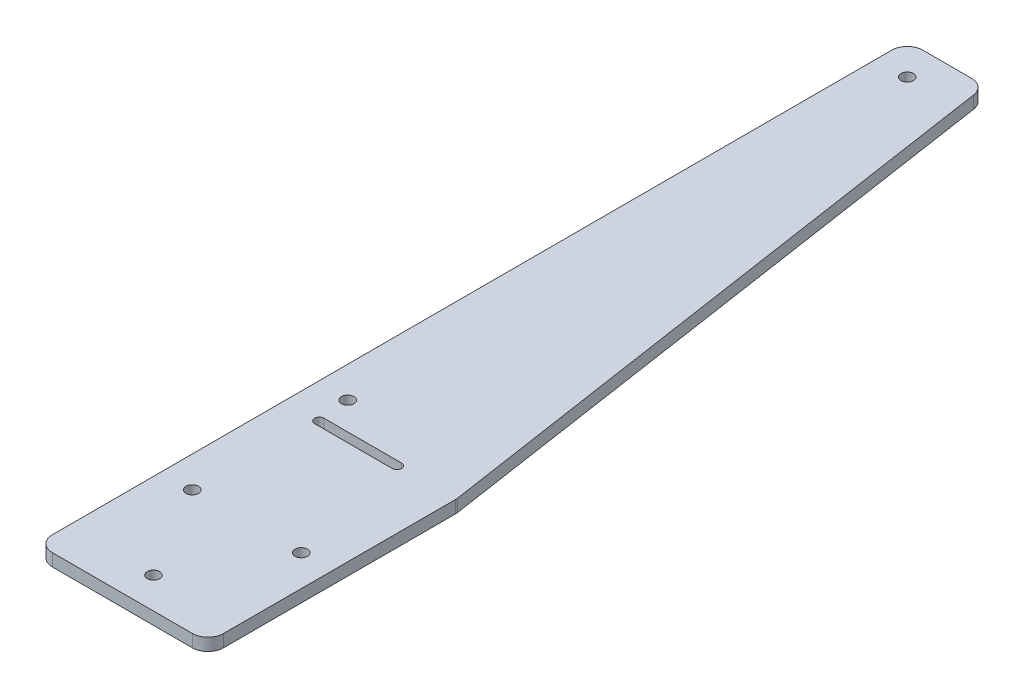
ISO-10303-21;
HEADER;
FILE_DESCRIPTION(('STEP AP214'),'2;1');
FILE_NAME('part.step','',(''),(''),'','','');
FILE_SCHEMA(('AUTOMOTIVE_DESIGN { 1 0 10303 214 1 1 1 1 }'));
ENDSEC;
DATA;
#1=APPLICATION_CONTEXT('core data for automotive mechanical design processes');
#2=APPLICATION_PROTOCOL_DEFINITION('international standard','automotive_design',2000,#1);
#3=PRODUCT_CONTEXT('',#1,'mechanical');
#4=PRODUCT('Part','Part','',(#3));
#5=PRODUCT_RELATED_PRODUCT_CATEGORY('part','',(#4));
#6=PRODUCT_DEFINITION_FORMATION('','',#4);
#7=PRODUCT_DEFINITION_CONTEXT('part definition',#1,'design');
#8=PRODUCT_DEFINITION('design','',#6,#7);
#9=PRODUCT_DEFINITION_SHAPE('','',#8);
#10=(LENGTH_UNIT() NAMED_UNIT(*) SI_UNIT(.MILLI.,.METRE.));
#11=(NAMED_UNIT(*) PLANE_ANGLE_UNIT() SI_UNIT($,.RADIAN.));
#12=(NAMED_UNIT(*) SI_UNIT($,.STERADIAN.) SOLID_ANGLE_UNIT());
#13=UNCERTAINTY_MEASURE_WITH_UNIT(LENGTH_MEASURE(1.E-05),#10,'distance_accuracy_value','');
#14=(GEOMETRIC_REPRESENTATION_CONTEXT(3) GLOBAL_UNCERTAINTY_ASSIGNED_CONTEXT((#13)) GLOBAL_UNIT_ASSIGNED_CONTEXT((#10,
#11,#12)) REPRESENTATION_CONTEXT('',''));
#15=CARTESIAN_POINT('',(0.,0.,0.));
#16=DIRECTION('',(0.,0.,1.));
#17=DIRECTION('',(1.,0.,0.));
#18=AXIS2_PLACEMENT_3D('',#15,#16,#17);
#19=CARTESIAN_POINT('',(-47.5,2.,80.8962264150943));
#20=DIRECTION('',(0.,1.,0.));
#21=DIRECTION('',(0.,0.,1.));
#22=AXIS2_PLACEMENT_3D('',#19,#20,#21);
#23=PLANE('',#22);
#24=CARTESIAN_POINT('',(-45.,2.,-51.6037735849057));
#25=DIRECTION('',(0.,1.,0.));
#26=DIRECTION('',(0.,0.,1.));
#27=AXIS2_PLACEMENT_3D('',#24,#25,#26);
#28=CIRCLE('',#27,0.999999999999998);
#29=CARTESIAN_POINT('',(-45.,2.,-50.6037735849057));
#30=VERTEX_POINT('',#29);
#31=EDGE_CURVE('E172',#30,#30,#28,.T.);
#32=ORIENTED_EDGE('',*,*,#31,.F.);
#33=EDGE_LOOP('',(#32));
#34=FACE_BOUND('',#33,.T.);
#35=CARTESIAN_POINT('',(-27.48,2.,63.3962264150943));
#36=DIRECTION('',(0.,1.,0.));
#37=DIRECTION('',(0.,0.,-1.));
#38=AXIS2_PLACEMENT_3D('',#35,#36,#37);
#39=CIRCLE('',#38,0.999999999999998);
#40=CARTESIAN_POINT('',(-27.48,2.,62.3962264150943));
#41=VERTEX_POINT('',#40);
#42=EDGE_CURVE('E184',#41,#41,#39,.T.);
#43=ORIENTED_EDGE('',*,*,#42,.F.);
#44=EDGE_LOOP('',(#43));
#45=FACE_BOUND('',#44,.T.);
#46=CARTESIAN_POINT('',(-36.24,2.,78.3962264150943));
#47=DIRECTION('',(0.,1.,0.));
#48=DIRECTION('',(0.,0.,1.));
#49=AXIS2_PLACEMENT_3D('',#46,#47,#48);
#50=CIRCLE('',#49,0.999999999999998);
#51=CARTESIAN_POINT('',(-36.24,2.,79.3962264150943));
#52=VERTEX_POINT('',#51);
#53=EDGE_CURVE('E196',#52,#52,#50,.T.);
#54=ORIENTED_EDGE('',*,*,#53,.F.);
#55=EDGE_LOOP('',(#54));
#56=FACE_BOUND('',#55,.T.);
#57=DIRECTION('',(0.,0.,1.));
#58=VECTOR('',#57,1.);
#59=CARTESIAN_POINT('',(-50.,2.,63.3962264150943));
#60=LINE('',#59,#58);
#61=CARTESIAN_POINT('',(-50.,2.,-54.1037735849057));
#62=VERTEX_POINT('',#61);
#63=CARTESIAN_POINT('',(-50.,2.,80.8962264150943));
#64=VERTEX_POINT('',#63);
#65=EDGE_CURVE('E202',#62,#64,#60,.T.);
#66=ORIENTED_EDGE('',*,*,#65,.T.);
#67=CARTESIAN_POINT('',(-47.5,2.,80.8962264150943));
#68=DIRECTION('',(0.,1.,0.));
#69=DIRECTION('',(0.,0.,1.));
#70=AXIS2_PLACEMENT_3D('',#67,#68,#69);
#71=CIRCLE('',#70,2.5);
#72=CARTESIAN_POINT('',(-47.5,2.,83.3962264150943));
#73=VERTEX_POINT('',#72);
#74=EDGE_CURVE('E204',#64,#73,#71,.T.);
#75=ORIENTED_EDGE('',*,*,#74,.T.);
#76=DIRECTION('',(1.,0.,0.));
#77=VECTOR('',#76,1.);
#78=CARTESIAN_POINT('',(-47.5,2.,83.3962264150943));
#79=LINE('',#78,#77);
#80=CARTESIAN_POINT('',(-24.98,2.,83.3962264150943));
#81=VERTEX_POINT('',#80);
#82=EDGE_CURVE('E207',#73,#81,#79,.T.);
#83=ORIENTED_EDGE('',*,*,#82,.T.);
#84=CARTESIAN_POINT('',(-24.98,2.,80.8962264150943));
#85=DIRECTION('',(0.,1.,0.));
#86=DIRECTION('',(0.,0.,1.));
#87=AXIS2_PLACEMENT_3D('',#84,#85,#86);
#88=CIRCLE('',#87,2.5);
#89=CARTESIAN_POINT('',(-22.48,2.,80.8962264150943));
#90=VERTEX_POINT('',#89);
#91=EDGE_CURVE('E209',#81,#90,#88,.T.);
#92=ORIENTED_EDGE('',*,*,#91,.T.);
#93=DIRECTION('',(0.,0.,-1.));
#94=VECTOR('',#93,1.);
#95=CARTESIAN_POINT('',(-22.48,2.,80.8962264150943));
#96=LINE('',#95,#94);
#97=CARTESIAN_POINT('',(-22.48,2.,43.582929281961));
#98=VERTEX_POINT('',#97);
#99=EDGE_CURVE('E211',#90,#98,#96,.T.);
#100=ORIENTED_EDGE('',*,*,#99,.T.);
#101=CARTESIAN_POINT('',(-24.98,2.,43.582929281961));
#102=DIRECTION('',(0.,1.,0.));
#103=DIRECTION('',(0.,0.,-1.));
#104=AXIS2_PLACEMENT_3D('',#101,#102,#103);
#105=CIRCLE('',#104,2.5);
#106=CARTESIAN_POINT('',(-22.5077317011103,2.,43.2115945834678));
#107=VERTEX_POINT('',#106);
#108=EDGE_CURVE('E213',#98,#107,#105,.T.);
#109=ORIENTED_EDGE('',*,*,#108,.T.);
#110=DIRECTION('',(-0.148533879397293,0.,-0.988907319555878));
#111=VECTOR('',#110,1.);
#112=CARTESIAN_POINT('',(-37.1802744717137,2.,-54.4751082833989));
#113=LINE('',#112,#111);
#114=CARTESIAN_POINT('',(-37.1802744717137,2.,-54.4751082833989));
#115=VERTEX_POINT('',#114);
#116=EDGE_CURVE('E215',#107,#115,#113,.T.);
#117=ORIENTED_EDGE('',*,*,#116,.T.);
#118=CARTESIAN_POINT('',(-39.6525427706034,2.,-54.1037735849057));
#119=DIRECTION('',(0.,1.,0.));
#120=DIRECTION('',(0.,0.,-1.));
#121=AXIS2_PLACEMENT_3D('',#118,#119,#120);
#122=CIRCLE('',#121,2.5);
#123=CARTESIAN_POINT('',(-39.6525427706034,2.,-56.6037735849057));
#124=VERTEX_POINT('',#123);
#125=EDGE_CURVE('E217',#115,#124,#122,.T.);
#126=ORIENTED_EDGE('',*,*,#125,.T.);
#127=DIRECTION('',(-1.,0.,0.));
#128=VECTOR('',#127,1.);
#129=CARTESIAN_POINT('',(-47.5,2.,-56.6037735849057));
#130=LINE('',#129,#128);
#131=CARTESIAN_POINT('',(-47.5,2.,-56.6037735849057));
#132=VERTEX_POINT('',#131);
#133=EDGE_CURVE('E219',#124,#132,#130,.T.);
#134=ORIENTED_EDGE('',*,*,#133,.T.);
#135=CARTESIAN_POINT('',(-47.5,2.,-54.1037735849057));
#136=DIRECTION('',(0.,1.,0.));
#137=DIRECTION('',(0.,0.,-1.));
#138=AXIS2_PLACEMENT_3D('',#135,#136,#137);
#139=CIRCLE('',#138,2.5);
#140=EDGE_CURVE('E221',#132,#62,#139,.T.);
#141=ORIENTED_EDGE('',*,*,#140,.T.);
#142=EDGE_LOOP('',(#66,#75,#83,#92,#100,#109,#117,#126,#134,#141));
#143=FACE_BOUND('',#142,.T.);
#144=CARTESIAN_POINT('',(-45.,2.,63.3962264150943));
#145=DIRECTION('',(0.,1.,0.));
#146=DIRECTION('',(0.,0.,1.));
#147=AXIS2_PLACEMENT_3D('',#144,#145,#146);
#148=CIRCLE('',#147,0.999999999999998);
#149=CARTESIAN_POINT('',(-45.,2.,64.3962264150943));
#150=VERTEX_POINT('',#149);
#151=EDGE_CURVE('E190',#150,#150,#148,.T.);
#152=ORIENTED_EDGE('',*,*,#151,.F.);
#153=EDGE_LOOP('',(#152));
#154=FACE_BOUND('',#153,.T.);
#155=CARTESIAN_POINT('',(-45.,2.,38.3962264150943));
#156=DIRECTION('',(0.,1.,0.));
#157=DIRECTION('',(0.,0.,1.));
#158=AXIS2_PLACEMENT_3D('',#155,#156,#157);
#159=CIRCLE('',#158,0.999999999999998);
#160=CARTESIAN_POINT('',(-45.,2.,39.3962264150943));
#161=VERTEX_POINT('',#160);
#162=EDGE_CURVE('E178',#161,#161,#159,.T.);
#163=ORIENTED_EDGE('',*,*,#162,.F.);
#164=EDGE_LOOP('',(#163));
#165=FACE_BOUND('',#164,.T.);
#166=DIRECTION('',(1.,0.,0.));
#167=VECTOR('',#166,1.);
#168=CARTESIAN_POINT('',(-44.38816659016,2.,44.332929281961));
#169=LINE('',#168,#167);
#170=CARTESIAN_POINT('',(-44.38816659016,2.,44.332929281961));
#171=VERTEX_POINT('',#170);
#172=CARTESIAN_POINT('',(-31.88816659016,2.,44.332929281961));
#173=VERTEX_POINT('',#172);
#174=EDGE_CURVE('E144',#171,#173,#169,.T.);
#175=ORIENTED_EDGE('',*,*,#174,.F.);
#176=CARTESIAN_POINT('',(-44.38816659016,2.,43.582929281961));
#177=DIRECTION('',(0.,1.,0.));
#178=DIRECTION('',(0.,0.,1.));
#179=AXIS2_PLACEMENT_3D('',#176,#177,#178);
#180=CIRCLE('',#179,0.750000000000001);
#181=CARTESIAN_POINT('',(-44.38816659016,2.,42.832929281961));
#182=VERTEX_POINT('',#181);
#183=EDGE_CURVE('E136',#182,#171,#180,.T.);
#184=ORIENTED_EDGE('',*,*,#183,.F.);
#185=DIRECTION('',(-1.,0.,0.));
#186=VECTOR('',#185,1.);
#187=CARTESIAN_POINT('',(-44.38816659016,2.,42.832929281961));
#188=LINE('',#187,#186);
#189=CARTESIAN_POINT('',(-31.88816659016,2.,42.832929281961));
#190=VERTEX_POINT('',#189);
#191=EDGE_CURVE('E158',#190,#182,#188,.T.);
#192=ORIENTED_EDGE('',*,*,#191,.F.);
#193=CARTESIAN_POINT('',(-31.88816659016,2.,43.582929281961));
#194=DIRECTION('',(0.,1.,0.));
#195=DIRECTION('',(0.,0.,1.));
#196=AXIS2_PLACEMENT_3D('',#193,#194,#195);
#197=CIRCLE('',#196,0.749999999999997);
#198=EDGE_CURVE('E156',#173,#190,#197,.T.);
#199=ORIENTED_EDGE('',*,*,#198,.F.);
#200=EDGE_LOOP('',(#175,#184,#192,#199));
#201=FACE_BOUND('',#200,.T.);
#202=ADVANCED_FACE('F35',(#34,#45,#56,#143,#154,#165,#201),#23,.T.);
#203=CARTESIAN_POINT('',(-47.5,0.,80.8962264150943));
#204=DIRECTION('',(0.,1.,0.));
#205=DIRECTION('',(0.,0.,1.));
#206=AXIS2_PLACEMENT_3D('',#203,#204,#205);
#207=PLANE('',#206);
#208=CARTESIAN_POINT('',(-45.,0.,-51.6037735849057));
#209=DIRECTION('',(0.,1.,0.));
#210=DIRECTION('',(0.,0.,1.));
#211=AXIS2_PLACEMENT_3D('',#208,#209,#210);
#212=CIRCLE('',#211,0.999999999999998);
#213=CARTESIAN_POINT('',(-45.,0.,-50.6037735849057));
#214=VERTEX_POINT('',#213);
#215=EDGE_CURVE('E152',#214,#214,#212,.T.);
#216=ORIENTED_EDGE('',*,*,#215,.T.);
#217=EDGE_LOOP('',(#216));
#218=FACE_BOUND('',#217,.T.);
#219=CARTESIAN_POINT('',(-27.48,0.,63.3962264150943));
#220=DIRECTION('',(0.,1.,0.));
#221=DIRECTION('',(0.,0.,-1.));
#222=AXIS2_PLACEMENT_3D('',#219,#220,#221);
#223=CIRCLE('',#222,0.999999999999998);
#224=CARTESIAN_POINT('',(-27.48,0.,62.3962264150943));
#225=VERTEX_POINT('',#224);
#226=EDGE_CURVE('E181',#225,#225,#223,.T.);
#227=ORIENTED_EDGE('',*,*,#226,.T.);
#228=EDGE_LOOP('',(#227));
#229=FACE_BOUND('',#228,.T.);
#230=CARTESIAN_POINT('',(-36.24,0.,78.3962264150943));
#231=DIRECTION('',(0.,1.,0.));
#232=DIRECTION('',(0.,0.,1.));
#233=AXIS2_PLACEMENT_3D('',#230,#231,#232);
#234=CIRCLE('',#233,0.999999999999998);
#235=CARTESIAN_POINT('',(-36.24,0.,79.3962264150943));
#236=VERTEX_POINT('',#235);
#237=EDGE_CURVE('E193',#236,#236,#234,.T.);
#238=ORIENTED_EDGE('',*,*,#237,.T.);
#239=EDGE_LOOP('',(#238));
#240=FACE_BOUND('',#239,.T.);
#241=CARTESIAN_POINT('',(-47.5,0.,80.8962264150943));
#242=DIRECTION('',(0.,1.,0.));
#243=DIRECTION('',(0.,0.,1.));
#244=AXIS2_PLACEMENT_3D('',#241,#242,#243);
#245=CIRCLE('',#244,2.5);
#246=CARTESIAN_POINT('',(-50.,0.,80.8962264150943));
#247=VERTEX_POINT('',#246);
#248=CARTESIAN_POINT('',(-47.5,0.,83.3962264150943));
#249=VERTEX_POINT('',#248);
#250=EDGE_CURVE('E199',#247,#249,#245,.T.);
#251=ORIENTED_EDGE('',*,*,#250,.F.);
#252=DIRECTION('',(0.,0.,1.));
#253=VECTOR('',#252,1.);
#254=CARTESIAN_POINT('',(-50.,0.,63.3962264150943));
#255=LINE('',#254,#253);
#256=CARTESIAN_POINT('',(-50.,0.,-54.1037735849057));
#257=VERTEX_POINT('',#256);
#258=EDGE_CURVE('E205',#257,#247,#255,.T.);
#259=ORIENTED_EDGE('',*,*,#258,.F.);
#260=CARTESIAN_POINT('',(-47.5,0.,-54.1037735849057));
#261=DIRECTION('',(0.,1.,0.));
#262=DIRECTION('',(0.,0.,-1.));
#263=AXIS2_PLACEMENT_3D('',#260,#261,#262);
#264=CIRCLE('',#263,2.5);
#265=CARTESIAN_POINT('',(-47.5,0.,-56.6037735849057));
#266=VERTEX_POINT('',#265);
#267=EDGE_CURVE('E241',#266,#257,#264,.T.);
#268=ORIENTED_EDGE('',*,*,#267,.F.);
#269=DIRECTION('',(-1.,0.,0.));
#270=VECTOR('',#269,1.);
#271=CARTESIAN_POINT('',(-47.5,0.,-56.6037735849057));
#272=LINE('',#271,#270);
#273=CARTESIAN_POINT('',(-39.6525427706034,0.,-56.6037735849057));
#274=VERTEX_POINT('',#273);
#275=EDGE_CURVE('E239',#274,#266,#272,.T.);
#276=ORIENTED_EDGE('',*,*,#275,.F.);
#277=CARTESIAN_POINT('',(-39.6525427706034,0.,-54.1037735849057));
#278=DIRECTION('',(0.,1.,0.));
#279=DIRECTION('',(0.,0.,-1.));
#280=AXIS2_PLACEMENT_3D('',#277,#278,#279);
#281=CIRCLE('',#280,2.5);
#282=CARTESIAN_POINT('',(-37.1802744717137,0.,-54.4751082833989));
#283=VERTEX_POINT('',#282);
#284=EDGE_CURVE('E237',#283,#274,#281,.T.);
#285=ORIENTED_EDGE('',*,*,#284,.F.);
#286=DIRECTION('',(-0.148533879397293,0.,-0.988907319555878));
#287=VECTOR('',#286,1.);
#288=CARTESIAN_POINT('',(-37.1802744717137,0.,-54.4751082833989));
#289=LINE('',#288,#287);
#290=CARTESIAN_POINT('',(-22.5077317011103,0.,43.2115945834678));
#291=VERTEX_POINT('',#290);
#292=EDGE_CURVE('E235',#291,#283,#289,.T.);
#293=ORIENTED_EDGE('',*,*,#292,.F.);
#294=CARTESIAN_POINT('',(-24.98,0.,43.582929281961));
#295=DIRECTION('',(0.,1.,0.));
#296=DIRECTION('',(0.,0.,-1.));
#297=AXIS2_PLACEMENT_3D('',#294,#295,#296);
#298=CIRCLE('',#297,2.5);
#299=CARTESIAN_POINT('',(-22.48,0.,43.582929281961));
#300=VERTEX_POINT('',#299);
#301=EDGE_CURVE('E233',#300,#291,#298,.T.);
#302=ORIENTED_EDGE('',*,*,#301,.F.);
#303=DIRECTION('',(0.,0.,-1.));
#304=VECTOR('',#303,1.);
#305=CARTESIAN_POINT('',(-22.48,0.,43.582929281961));
#306=LINE('',#305,#304);
#307=CARTESIAN_POINT('',(-22.48,0.,80.8962264150943));
#308=VERTEX_POINT('',#307);
#309=EDGE_CURVE('E231',#308,#300,#306,.T.);
#310=ORIENTED_EDGE('',*,*,#309,.F.);
#311=CARTESIAN_POINT('',(-24.98,0.,80.8962264150943));
#312=DIRECTION('',(0.,1.,0.));
#313=DIRECTION('',(0.,0.,1.));
#314=AXIS2_PLACEMENT_3D('',#311,#312,#313);
#315=CIRCLE('',#314,2.5);
#316=CARTESIAN_POINT('',(-24.98,0.,83.3962264150943));
#317=VERTEX_POINT('',#316);
#318=EDGE_CURVE('E228',#317,#308,#315,.T.);
#319=ORIENTED_EDGE('',*,*,#318,.F.);
#320=DIRECTION('',(1.,0.,0.));
#321=VECTOR('',#320,1.);
#322=CARTESIAN_POINT('',(-47.5,0.,83.3962264150943));
#323=LINE('',#322,#321);
#324=EDGE_CURVE('E226',#249,#317,#323,.T.);
#325=ORIENTED_EDGE('',*,*,#324,.F.);
#326=EDGE_LOOP('',(#251,#259,#268,#276,#285,#293,#302,#310,#319,#325));
#327=FACE_BOUND('',#326,.T.);
#328=CARTESIAN_POINT('',(-45.,0.,63.3962264150943));
#329=DIRECTION('',(0.,1.,0.));
#330=DIRECTION('',(0.,0.,1.));
#331=AXIS2_PLACEMENT_3D('',#328,#329,#330);
#332=CIRCLE('',#331,0.999999999999998);
#333=CARTESIAN_POINT('',(-45.,0.,64.3962264150943));
#334=VERTEX_POINT('',#333);
#335=EDGE_CURVE('E187',#334,#334,#332,.T.);
#336=ORIENTED_EDGE('',*,*,#335,.T.);
#337=EDGE_LOOP('',(#336));
#338=FACE_BOUND('',#337,.T.);
#339=CARTESIAN_POINT('',(-45.,0.,38.3962264150943));
#340=DIRECTION('',(0.,1.,0.));
#341=DIRECTION('',(0.,0.,1.));
#342=AXIS2_PLACEMENT_3D('',#339,#340,#341);
#343=CIRCLE('',#342,0.999999999999998);
#344=CARTESIAN_POINT('',(-45.,0.,39.3962264150943));
#345=VERTEX_POINT('',#344);
#346=EDGE_CURVE('E175',#345,#345,#343,.T.);
#347=ORIENTED_EDGE('',*,*,#346,.T.);
#348=EDGE_LOOP('',(#347));
#349=FACE_BOUND('',#348,.T.);
#350=CARTESIAN_POINT('',(-44.38816659016,0.,43.582929281961));
#351=DIRECTION('',(0.,1.,0.));
#352=DIRECTION('',(0.,0.,1.));
#353=AXIS2_PLACEMENT_3D('',#350,#351,#352);
#354=CIRCLE('',#353,0.750000000000001);
#355=CARTESIAN_POINT('',(-44.38816659016,0.,42.832929281961));
#356=VERTEX_POINT('',#355);
#357=CARTESIAN_POINT('',(-44.38816659016,0.,44.332929281961));
#358=VERTEX_POINT('',#357);
#359=EDGE_CURVE('E58',#356,#358,#354,.T.);
#360=ORIENTED_EDGE('',*,*,#359,.T.);
#361=DIRECTION('',(1.,0.,0.));
#362=VECTOR('',#361,1.);
#363=CARTESIAN_POINT('',(-44.38816659016,0.,44.332929281961));
#364=LINE('',#363,#362);
#365=CARTESIAN_POINT('',(-31.88816659016,0.,44.332929281961));
#366=VERTEX_POINT('',#365);
#367=EDGE_CURVE('E151',#358,#366,#364,.T.);
#368=ORIENTED_EDGE('',*,*,#367,.T.);
#369=CARTESIAN_POINT('',(-31.88816659016,0.,43.582929281961));
#370=DIRECTION('',(0.,1.,0.));
#371=DIRECTION('',(0.,0.,1.));
#372=AXIS2_PLACEMENT_3D('',#369,#370,#371);
#373=CIRCLE('',#372,0.749999999999997);
#374=CARTESIAN_POINT('',(-31.88816659016,0.,42.832929281961));
#375=VERTEX_POINT('',#374);
#376=EDGE_CURVE('E164',#366,#375,#373,.T.);
#377=ORIENTED_EDGE('',*,*,#376,.T.);
#378=DIRECTION('',(-1.,0.,0.));
#379=VECTOR('',#378,1.);
#380=CARTESIAN_POINT('',(-44.38816659016,0.,42.832929281961));
#381=LINE('',#380,#379);
#382=EDGE_CURVE('E145',#375,#356,#381,.T.);
#383=ORIENTED_EDGE('',*,*,#382,.T.);
#384=EDGE_LOOP('',(#360,#368,#377,#383));
#385=FACE_BOUND('',#384,.T.);
#386=ADVANCED_FACE('F278',(#218,#229,#240,#327,#338,#349,#385),#207,.F.);
#387=CARTESIAN_POINT('',(-47.5,2.,80.8962264150943));
#388=DIRECTION('',(0.,-1.,0.));
#389=DIRECTION('',(0.,0.,-1.));
#390=AXIS2_PLACEMENT_3D('',#387,#388,#389);
#391=CYLINDRICAL_SURFACE('',#390,2.5);
#392=ORIENTED_EDGE('',*,*,#250,.T.);
#393=DIRECTION('',(0.,-1.,0.));
#394=VECTOR('',#393,1.);
#395=CARTESIAN_POINT('',(-47.5,2.,83.3962264150943));
#396=LINE('',#395,#394);
#397=EDGE_CURVE('E43',#73,#249,#396,.T.);
#398=ORIENTED_EDGE('',*,*,#397,.F.);
#399=ORIENTED_EDGE('',*,*,#74,.F.);
#400=DIRECTION('',(0.,-1.,0.));
#401=VECTOR('',#400,1.);
#402=CARTESIAN_POINT('',(-50.,2.,80.8962264150943));
#403=LINE('',#402,#401);
#404=EDGE_CURVE('E11',#64,#247,#403,.T.);
#405=ORIENTED_EDGE('',*,*,#404,.T.);
#406=EDGE_LOOP('',(#392,#398,#399,#405));
#407=FACE_BOUND('',#406,.T.);
#408=ADVANCED_FACE('F37',(#407),#391,.T.);
#409=CARTESIAN_POINT('',(-47.5,2.,83.3962264150943));
#410=DIRECTION('',(0.,0.,-1.));
#411=DIRECTION('',(-1.,0.,0.));
#412=AXIS2_PLACEMENT_3D('',#409,#410,#411);
#413=PLANE('',#412);
#414=ORIENTED_EDGE('',*,*,#324,.T.);
#415=DIRECTION('',(0.,-1.,0.));
#416=VECTOR('',#415,1.);
#417=CARTESIAN_POINT('',(-24.98,2.,83.3962264150943));
#418=LINE('',#417,#416);
#419=EDGE_CURVE('E264',#81,#317,#418,.T.);
#420=ORIENTED_EDGE('',*,*,#419,.F.);
#421=ORIENTED_EDGE('',*,*,#82,.F.);
#422=ORIENTED_EDGE('',*,*,#397,.T.);
#423=EDGE_LOOP('',(#414,#420,#421,#422));
#424=FACE_BOUND('',#423,.T.);
#425=ADVANCED_FACE('F271',(#424),#413,.F.);
#426=CARTESIAN_POINT('',(-24.98,2.,80.8962264150943));
#427=DIRECTION('',(0.,-1.,0.));
#428=DIRECTION('',(0.,0.,-1.));
#429=AXIS2_PLACEMENT_3D('',#426,#427,#428);
#430=CYLINDRICAL_SURFACE('',#429,2.5);
#431=ORIENTED_EDGE('',*,*,#318,.T.);
#432=DIRECTION('',(0.,-1.,0.));
#433=VECTOR('',#432,1.);
#434=CARTESIAN_POINT('',(-22.48,2.,80.8962264150943));
#435=LINE('',#434,#433);
#436=EDGE_CURVE('E261',#90,#308,#435,.T.);
#437=ORIENTED_EDGE('',*,*,#436,.F.);
#438=ORIENTED_EDGE('',*,*,#91,.F.);
#439=ORIENTED_EDGE('',*,*,#419,.T.);
#440=EDGE_LOOP('',(#431,#437,#438,#439));
#441=FACE_BOUND('',#440,.T.);
#442=ADVANCED_FACE('F284',(#441),#430,.T.);
#443=CARTESIAN_POINT('',(-22.48,2.,43.582929281961));
#444=DIRECTION('',(-1.,0.,0.));
#445=DIRECTION('',(0.,0.,1.));
#446=AXIS2_PLACEMENT_3D('',#443,#444,#445);
#447=PLANE('',#446);
#448=ORIENTED_EDGE('',*,*,#309,.T.);
#449=DIRECTION('',(0.,-1.,0.));
#450=VECTOR('',#449,1.);
#451=CARTESIAN_POINT('',(-22.48,2.,43.582929281961));
#452=LINE('',#451,#450);
#453=EDGE_CURVE('E258',#98,#300,#452,.T.);
#454=ORIENTED_EDGE('',*,*,#453,.F.);
#455=ORIENTED_EDGE('',*,*,#99,.F.);
#456=ORIENTED_EDGE('',*,*,#436,.T.);
#457=EDGE_LOOP('',(#448,#454,#455,#456));
#458=FACE_BOUND('',#457,.T.);
#459=ADVANCED_FACE('F288',(#458),#447,.F.);
#460=CARTESIAN_POINT('',(-24.98,2.,43.582929281961));
#461=DIRECTION('',(0.,-1.,0.));
#462=DIRECTION('',(0.,0.,-1.));
#463=AXIS2_PLACEMENT_3D('',#460,#461,#462);
#464=CYLINDRICAL_SURFACE('',#463,2.5);
#465=ORIENTED_EDGE('',*,*,#301,.T.);
#466=DIRECTION('',(0.,-1.,0.));
#467=VECTOR('',#466,1.);
#468=CARTESIAN_POINT('',(-22.5077317011103,2.,43.2115945834678));
#469=LINE('',#468,#467);
#470=EDGE_CURVE('E255',#107,#291,#469,.T.);
#471=ORIENTED_EDGE('',*,*,#470,.F.);
#472=ORIENTED_EDGE('',*,*,#108,.F.);
#473=ORIENTED_EDGE('',*,*,#453,.T.);
#474=EDGE_LOOP('',(#465,#471,#472,#473));
#475=FACE_BOUND('',#474,.T.);
#476=ADVANCED_FACE('F318',(#475),#464,.T.);
#477=CARTESIAN_POINT('',(-37.1802744717137,2.,-54.4751082833989));
#478=DIRECTION('',(-0.988907319555878,0.,0.148533879397293));
#479=DIRECTION('',(0.148533879397293,0.,0.988907319555878));
#480=AXIS2_PLACEMENT_3D('',#477,#478,#479);
#481=PLANE('',#480);
#482=ORIENTED_EDGE('',*,*,#292,.T.);
#483=DIRECTION('',(0.,-1.,0.));
#484=VECTOR('',#483,1.);
#485=CARTESIAN_POINT('',(-37.1802744717137,2.,-54.4751082833989));
#486=LINE('',#485,#484);
#487=EDGE_CURVE('E252',#115,#283,#486,.T.);
#488=ORIENTED_EDGE('',*,*,#487,.F.);
#489=ORIENTED_EDGE('',*,*,#116,.F.);
#490=ORIENTED_EDGE('',*,*,#470,.T.);
#491=EDGE_LOOP('',(#482,#488,#489,#490));
#492=FACE_BOUND('',#491,.T.);
#493=ADVANCED_FACE('F315',(#492),#481,.F.);
#494=CARTESIAN_POINT('',(-39.6525427706034,2.,-54.1037735849057));
#495=DIRECTION('',(0.,-1.,0.));
#496=DIRECTION('',(0.,0.,-1.));
#497=AXIS2_PLACEMENT_3D('',#494,#495,#496);
#498=CYLINDRICAL_SURFACE('',#497,2.5);
#499=ORIENTED_EDGE('',*,*,#284,.T.);
#500=DIRECTION('',(0.,-1.,0.));
#501=VECTOR('',#500,1.);
#502=CARTESIAN_POINT('',(-39.6525427706034,2.,-56.6037735849057));
#503=LINE('',#502,#501);
#504=EDGE_CURVE('E249',#124,#274,#503,.T.);
#505=ORIENTED_EDGE('',*,*,#504,.F.);
#506=ORIENTED_EDGE('',*,*,#125,.F.);
#507=ORIENTED_EDGE('',*,*,#487,.T.);
#508=EDGE_LOOP('',(#499,#505,#506,#507));
#509=FACE_BOUND('',#508,.T.);
#510=ADVANCED_FACE('F311',(#509),#498,.T.);
#511=CARTESIAN_POINT('',(-47.5,2.,-56.6037735849057));
#512=DIRECTION('',(0.,0.,1.));
#513=DIRECTION('',(1.,0.,0.));
#514=AXIS2_PLACEMENT_3D('',#511,#512,#513);
#515=PLANE('',#514);
#516=ORIENTED_EDGE('',*,*,#275,.T.);
#517=DIRECTION('',(0.,-1.,0.));
#518=VECTOR('',#517,1.);
#519=CARTESIAN_POINT('',(-47.5,2.,-56.6037735849057));
#520=LINE('',#519,#518);
#521=EDGE_CURVE('E246',#132,#266,#520,.T.);
#522=ORIENTED_EDGE('',*,*,#521,.F.);
#523=ORIENTED_EDGE('',*,*,#133,.F.);
#524=ORIENTED_EDGE('',*,*,#504,.T.);
#525=EDGE_LOOP('',(#516,#522,#523,#524));
#526=FACE_BOUND('',#525,.T.);
#527=ADVANCED_FACE('F307',(#526),#515,.F.);
#528=CARTESIAN_POINT('',(-47.5,2.,-54.1037735849057));
#529=DIRECTION('',(0.,-1.,0.));
#530=DIRECTION('',(0.,0.,-1.));
#531=AXIS2_PLACEMENT_3D('',#528,#529,#530);
#532=CYLINDRICAL_SURFACE('',#531,2.5);
#533=ORIENTED_EDGE('',*,*,#267,.T.);
#534=DIRECTION('',(0.,-1.,0.));
#535=VECTOR('',#534,1.);
#536=CARTESIAN_POINT('',(-50.,2.,-54.1037735849057));
#537=LINE('',#536,#535);
#538=EDGE_CURVE('E224',#62,#257,#537,.T.);
#539=ORIENTED_EDGE('',*,*,#538,.F.);
#540=ORIENTED_EDGE('',*,*,#140,.F.);
#541=ORIENTED_EDGE('',*,*,#521,.T.);
#542=EDGE_LOOP('',(#533,#539,#540,#541));
#543=FACE_BOUND('',#542,.T.);
#544=ADVANCED_FACE('F302',(#543),#532,.T.);
#545=CARTESIAN_POINT('',(-50.,2.,63.3962264150943));
#546=DIRECTION('',(1.,0.,0.));
#547=DIRECTION('',(0.,0.,-1.));
#548=AXIS2_PLACEMENT_3D('',#545,#546,#547);
#549=PLANE('',#548);
#550=ORIENTED_EDGE('',*,*,#258,.T.);
#551=ORIENTED_EDGE('',*,*,#404,.F.);
#552=ORIENTED_EDGE('',*,*,#65,.F.);
#553=ORIENTED_EDGE('',*,*,#538,.T.);
#554=EDGE_LOOP('',(#550,#551,#552,#553));
#555=FACE_BOUND('',#554,.T.);
#556=ADVANCED_FACE('F296',(#555),#549,.F.);
#557=CARTESIAN_POINT('',(-36.24,2.,78.3962264150943));
#558=DIRECTION('',(0.,-1.,0.));
#559=DIRECTION('',(0.,0.,-1.));
#560=AXIS2_PLACEMENT_3D('',#557,#558,#559);
#561=CYLINDRICAL_SURFACE('',#560,0.999999999999998);
#562=ORIENTED_EDGE('',*,*,#53,.T.);
#563=EDGE_LOOP('',(#562));
#564=FACE_BOUND('',#563,.T.);
#565=ORIENTED_EDGE('',*,*,#237,.F.);
#566=EDGE_LOOP('',(#565));
#567=FACE_BOUND('',#566,.T.);
#568=ADVANCED_FACE('F338',(#564,#567),#561,.F.);
#569=CARTESIAN_POINT('',(-45.,2.,63.3962264150943));
#570=DIRECTION('',(0.,-1.,0.));
#571=DIRECTION('',(0.,0.,-1.));
#572=AXIS2_PLACEMENT_3D('',#569,#570,#571);
#573=CYLINDRICAL_SURFACE('',#572,0.999999999999998);
#574=ORIENTED_EDGE('',*,*,#151,.T.);
#575=EDGE_LOOP('',(#574));
#576=FACE_BOUND('',#575,.T.);
#577=ORIENTED_EDGE('',*,*,#335,.F.);
#578=EDGE_LOOP('',(#577));
#579=FACE_BOUND('',#578,.T.);
#580=ADVANCED_FACE('F370',(#576,#579),#573,.F.);
#581=CARTESIAN_POINT('',(-27.48,2.,63.3962264150943));
#582=DIRECTION('',(0.,-1.,0.));
#583=DIRECTION('',(0.,0.,-1.));
#584=AXIS2_PLACEMENT_3D('',#581,#582,#583);
#585=CYLINDRICAL_SURFACE('',#584,0.999999999999998);
#586=ORIENTED_EDGE('',*,*,#42,.T.);
#587=EDGE_LOOP('',(#586));
#588=FACE_BOUND('',#587,.T.);
#589=ORIENTED_EDGE('',*,*,#226,.F.);
#590=EDGE_LOOP('',(#589));
#591=FACE_BOUND('',#590,.T.);
#592=ADVANCED_FACE('F377',(#588,#591),#585,.F.);
#593=CARTESIAN_POINT('',(-45.,2.,38.3962264150943));
#594=DIRECTION('',(0.,-1.,0.));
#595=DIRECTION('',(0.,0.,-1.));
#596=AXIS2_PLACEMENT_3D('',#593,#594,#595);
#597=CYLINDRICAL_SURFACE('',#596,0.999999999999998);
#598=ORIENTED_EDGE('',*,*,#162,.T.);
#599=EDGE_LOOP('',(#598));
#600=FACE_BOUND('',#599,.T.);
#601=ORIENTED_EDGE('',*,*,#346,.F.);
#602=EDGE_LOOP('',(#601));
#603=FACE_BOUND('',#602,.T.);
#604=ADVANCED_FACE('F384',(#600,#603),#597,.F.);
#605=CARTESIAN_POINT('',(-45.,2.,-51.6037735849057));
#606=DIRECTION('',(0.,-1.,0.));
#607=DIRECTION('',(0.,0.,-1.));
#608=AXIS2_PLACEMENT_3D('',#605,#606,#607);
#609=CYLINDRICAL_SURFACE('',#608,0.999999999999998);
#610=ORIENTED_EDGE('',*,*,#31,.T.);
#611=EDGE_LOOP('',(#610));
#612=FACE_BOUND('',#611,.T.);
#613=ORIENTED_EDGE('',*,*,#215,.F.);
#614=EDGE_LOOP('',(#613));
#615=FACE_BOUND('',#614,.T.);
#616=ADVANCED_FACE('F392',(#612,#615),#609,.F.);
#617=CARTESIAN_POINT('',(-44.38816659016,2.,43.582929281961));
#618=DIRECTION('',(0.,-1.,0.));
#619=DIRECTION('',(0.,0.,-1.));
#620=AXIS2_PLACEMENT_3D('',#617,#618,#619);
#621=CYLINDRICAL_SURFACE('',#620,0.750000000000001);
#622=ORIENTED_EDGE('',*,*,#359,.F.);
#623=DIRECTION('',(0.,-1.,0.));
#624=VECTOR('',#623,1.);
#625=CARTESIAN_POINT('',(-44.38816659016,2.,42.832929281961));
#626=LINE('',#625,#624);
#627=EDGE_CURVE('E140',#182,#356,#626,.T.);
#628=ORIENTED_EDGE('',*,*,#627,.F.);
#629=ORIENTED_EDGE('',*,*,#183,.T.);
#630=DIRECTION('',(0.,-1.,0.));
#631=VECTOR('',#630,1.);
#632=CARTESIAN_POINT('',(-44.38816659016,2.,44.332929281961));
#633=LINE('',#632,#631);
#634=EDGE_CURVE('E139',#171,#358,#633,.T.);
#635=ORIENTED_EDGE('',*,*,#634,.T.);
#636=EDGE_LOOP('',(#622,#628,#629,#635));
#637=FACE_BOUND('',#636,.T.);
#638=ADVANCED_FACE('F138',(#637),#621,.F.);
#639=CARTESIAN_POINT('',(-44.38816659016,2.,44.332929281961));
#640=DIRECTION('',(0.,0.,-1.));
#641=DIRECTION('',(-1.,0.,0.));
#642=AXIS2_PLACEMENT_3D('',#639,#640,#641);
#643=PLANE('',#642);
#644=ORIENTED_EDGE('',*,*,#367,.F.);
#645=ORIENTED_EDGE('',*,*,#634,.F.);
#646=ORIENTED_EDGE('',*,*,#174,.T.);
#647=DIRECTION('',(0.,-1.,0.));
#648=VECTOR('',#647,1.);
#649=CARTESIAN_POINT('',(-31.88816659016,2.,44.332929281961));
#650=LINE('',#649,#648);
#651=EDGE_CURVE('E153',#173,#366,#650,.T.);
#652=ORIENTED_EDGE('',*,*,#651,.T.);
#653=EDGE_LOOP('',(#644,#645,#646,#652));
#654=FACE_BOUND('',#653,.T.);
#655=ADVANCED_FACE('F148',(#654),#643,.T.);
#656=CARTESIAN_POINT('',(-31.88816659016,2.,43.582929281961));
#657=DIRECTION('',(0.,-1.,0.));
#658=DIRECTION('',(0.,0.,-1.));
#659=AXIS2_PLACEMENT_3D('',#656,#657,#658);
#660=CYLINDRICAL_SURFACE('',#659,0.749999999999997);
#661=ORIENTED_EDGE('',*,*,#376,.F.);
#662=ORIENTED_EDGE('',*,*,#651,.F.);
#663=ORIENTED_EDGE('',*,*,#198,.T.);
#664=DIRECTION('',(0.,-1.,0.));
#665=VECTOR('',#664,1.);
#666=CARTESIAN_POINT('',(-31.88816659016,2.,42.832929281961));
#667=LINE('',#666,#665);
#668=EDGE_CURVE('E50',#190,#375,#667,.T.);
#669=ORIENTED_EDGE('',*,*,#668,.T.);
#670=EDGE_LOOP('',(#661,#662,#663,#669));
#671=FACE_BOUND('',#670,.T.);
#672=ADVANCED_FACE('F413',(#671),#660,.F.);
#673=CARTESIAN_POINT('',(-44.38816659016,2.,42.832929281961));
#674=DIRECTION('',(0.,0.,1.));
#675=DIRECTION('',(1.,0.,0.));
#676=AXIS2_PLACEMENT_3D('',#673,#674,#675);
#677=PLANE('',#676);
#678=ORIENTED_EDGE('',*,*,#382,.F.);
#679=ORIENTED_EDGE('',*,*,#668,.F.);
#680=ORIENTED_EDGE('',*,*,#191,.T.);
#681=ORIENTED_EDGE('',*,*,#627,.T.);
#682=EDGE_LOOP('',(#678,#679,#680,#681));
#683=FACE_BOUND('',#682,.T.);
#684=ADVANCED_FACE('F420',(#683),#677,.T.);
#685=CLOSED_SHELL('',(#202,#386,#408,#425,#442,#459,#476,#493,#510,#527,#544,#556,#568,#580,
#592,#604,#616,#638,#655,#672,#684));
#686=MANIFOLD_SOLID_BREP('B2',#685);
#687=ADVANCED_BREP_SHAPE_REPRESENTATION('',(#18,#686),#14);
#688=SHAPE_DEFINITION_REPRESENTATION(#9,#687);
ENDSEC;
END-ISO-10303-21;
